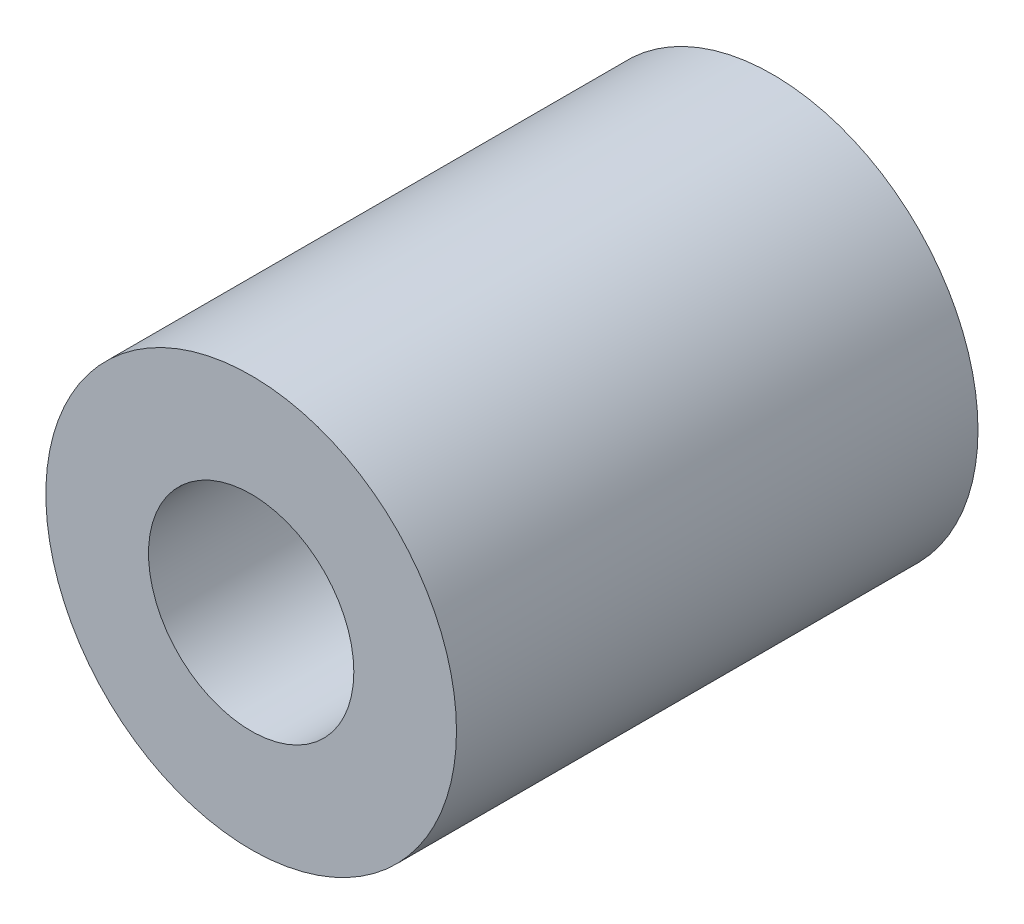
ISO-10303-21;
HEADER;
FILE_DESCRIPTION(('STEP AP214'),'2;1');
FILE_NAME('part.step','',(''),(''),'','','');
FILE_SCHEMA(('AUTOMOTIVE_DESIGN { 1 0 10303 214 1 1 1 1 }'));
ENDSEC;
DATA;
#1=APPLICATION_CONTEXT('core data for automotive mechanical design processes');
#2=APPLICATION_PROTOCOL_DEFINITION('international standard','automotive_design',2000,#1);
#3=PRODUCT_CONTEXT('',#1,'mechanical');
#4=PRODUCT('Part','Part','',(#3));
#5=PRODUCT_RELATED_PRODUCT_CATEGORY('part','',(#4));
#6=PRODUCT_DEFINITION_FORMATION('','',#4);
#7=PRODUCT_DEFINITION_CONTEXT('part definition',#1,'design');
#8=PRODUCT_DEFINITION('design','',#6,#7);
#9=PRODUCT_DEFINITION_SHAPE('','',#8);
#10=(LENGTH_UNIT() NAMED_UNIT(*) SI_UNIT(.MILLI.,.METRE.));
#11=(NAMED_UNIT(*) PLANE_ANGLE_UNIT() SI_UNIT($,.RADIAN.));
#12=(NAMED_UNIT(*) SI_UNIT($,.STERADIAN.) SOLID_ANGLE_UNIT());
#13=UNCERTAINTY_MEASURE_WITH_UNIT(LENGTH_MEASURE(1.E-05),#10,'distance_accuracy_value','');
#14=(GEOMETRIC_REPRESENTATION_CONTEXT(3) GLOBAL_UNCERTAINTY_ASSIGNED_CONTEXT((#13)) GLOBAL_UNIT_ASSIGNED_CONTEXT((#10,
#11,#12)) REPRESENTATION_CONTEXT('',''));
#15=CARTESIAN_POINT('',(0.,0.,0.));
#16=DIRECTION('',(0.,0.,1.));
#17=DIRECTION('',(1.,0.,0.));
#18=AXIS2_PLACEMENT_3D('',#15,#16,#17);
#19=CARTESIAN_POINT('',(0.,0.,12.7));
#20=DIRECTION('',(0.,0.,-1.));
#21=DIRECTION('',(-1.,0.,0.));
#22=AXIS2_PLACEMENT_3D('',#19,#20,#21);
#23=CYLINDRICAL_SURFACE('',#22,5.);
#24=CARTESIAN_POINT('',(0.,0.,12.7));
#25=DIRECTION('',(0.,0.,1.));
#26=DIRECTION('',(1.,0.,0.));
#27=AXIS2_PLACEMENT_3D('',#24,#25,#26);
#28=CIRCLE('',#27,5.);
#29=CARTESIAN_POINT('',(5.,0.,12.7));
#30=VERTEX_POINT('',#29);
#31=EDGE_CURVE('E10',#30,#30,#28,.T.);
#32=ORIENTED_EDGE('',*,*,#31,.F.);
#33=EDGE_LOOP('',(#32));
#34=FACE_BOUND('',#33,.T.);
#35=CARTESIAN_POINT('',(0.,0.,0.));
#36=DIRECTION('',(0.,0.,1.));
#37=DIRECTION('',(1.,0.,0.));
#38=AXIS2_PLACEMENT_3D('',#35,#36,#37);
#39=CIRCLE('',#38,5.);
#40=CARTESIAN_POINT('',(5.,0.,0.));
#41=VERTEX_POINT('',#40);
#42=EDGE_CURVE('E36',#41,#41,#39,.T.);
#43=ORIENTED_EDGE('',*,*,#42,.T.);
#44=EDGE_LOOP('',(#43));
#45=FACE_BOUND('',#44,.T.);
#46=ADVANCED_FACE('F33',(#34,#45),#23,.T.);
#47=CARTESIAN_POINT('',(0.,0.,12.7));
#48=DIRECTION('',(0.,0.,1.));
#49=DIRECTION('',(1.,0.,0.));
#50=AXIS2_PLACEMENT_3D('',#47,#48,#49);
#51=PLANE('',#50);
#52=CARTESIAN_POINT('',(0.,0.,12.7));
#53=DIRECTION('',(0.,0.,1.));
#54=DIRECTION('',(1.,0.,0.));
#55=AXIS2_PLACEMENT_3D('',#52,#53,#54);
#56=CIRCLE('',#55,2.5);
#57=CARTESIAN_POINT('',(2.5,0.,12.7));
#58=VERTEX_POINT('',#57);
#59=EDGE_CURVE('E47',#58,#58,#56,.T.);
#60=ORIENTED_EDGE('',*,*,#59,.F.);
#61=EDGE_LOOP('',(#60));
#62=FACE_BOUND('',#61,.T.);
#63=ORIENTED_EDGE('',*,*,#31,.T.);
#64=EDGE_LOOP('',(#63));
#65=FACE_BOUND('',#64,.T.);
#66=ADVANCED_FACE('F53',(#62,#65),#51,.T.);
#67=CARTESIAN_POINT('',(0.,0.,0.));
#68=DIRECTION('',(0.,0.,1.));
#69=DIRECTION('',(1.,0.,0.));
#70=AXIS2_PLACEMENT_3D('',#67,#68,#69);
#71=PLANE('',#70);
#72=CARTESIAN_POINT('',(0.,0.,0.));
#73=DIRECTION('',(0.,0.,1.));
#74=DIRECTION('',(1.,0.,0.));
#75=AXIS2_PLACEMENT_3D('',#72,#73,#74);
#76=CIRCLE('',#75,2.5);
#77=CARTESIAN_POINT('',(2.5,0.,0.));
#78=VERTEX_POINT('',#77);
#79=EDGE_CURVE('E43',#78,#78,#76,.T.);
#80=ORIENTED_EDGE('',*,*,#79,.T.);
#81=EDGE_LOOP('',(#80));
#82=FACE_BOUND('',#81,.T.);
#83=ORIENTED_EDGE('',*,*,#42,.F.);
#84=EDGE_LOOP('',(#83));
#85=FACE_BOUND('',#84,.T.);
#86=ADVANCED_FACE('F55',(#82,#85),#71,.F.);
#87=CARTESIAN_POINT('',(0.,0.,12.7));
#88=DIRECTION('',(0.,0.,1.));
#89=DIRECTION('',(1.,0.,0.));
#90=AXIS2_PLACEMENT_3D('',#87,#88,#89);
#91=CYLINDRICAL_SURFACE('',#90,2.5);
#92=ORIENTED_EDGE('',*,*,#79,.F.);
#93=EDGE_LOOP('',(#92));
#94=FACE_BOUND('',#93,.T.);
#95=ORIENTED_EDGE('',*,*,#59,.T.);
#96=EDGE_LOOP('',(#95));
#97=FACE_BOUND('',#96,.T.);
#98=ADVANCED_FACE('F51',(#94,#97),#91,.F.);
#99=CLOSED_SHELL('',(#46,#66,#86,#98));
#100=MANIFOLD_SOLID_BREP('B2',#99);
#101=ADVANCED_BREP_SHAPE_REPRESENTATION('',(#18,#100),#14);
#102=SHAPE_DEFINITION_REPRESENTATION(#9,#101);
ENDSEC;
END-ISO-10303-21;
